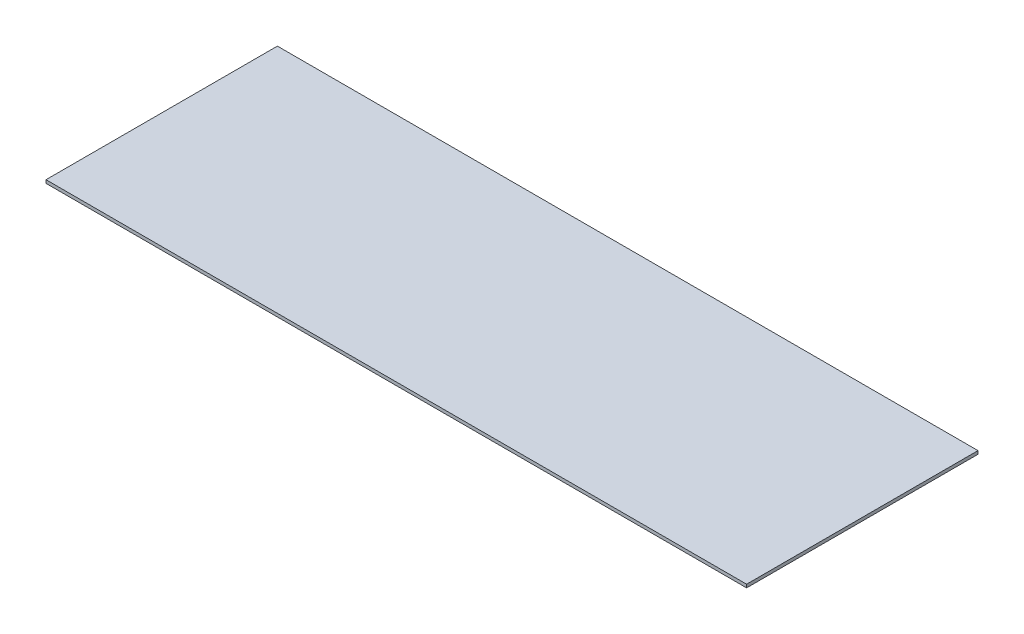
ISO-10303-21;
HEADER;
FILE_DESCRIPTION(('STEP AP214'),'2;1');
FILE_NAME('part.step','',(''),(''),'','','');
FILE_SCHEMA(('AUTOMOTIVE_DESIGN { 1 0 10303 214 1 1 1 1 }'));
ENDSEC;
DATA;
#1=APPLICATION_CONTEXT('core data for automotive mechanical design processes');
#2=APPLICATION_PROTOCOL_DEFINITION('international standard','automotive_design',2000,#1);
#3=PRODUCT_CONTEXT('',#1,'mechanical');
#4=PRODUCT('Part','Part','',(#3));
#5=PRODUCT_RELATED_PRODUCT_CATEGORY('part','',(#4));
#6=PRODUCT_DEFINITION_FORMATION('','',#4);
#7=PRODUCT_DEFINITION_CONTEXT('part definition',#1,'design');
#8=PRODUCT_DEFINITION('design','',#6,#7);
#9=PRODUCT_DEFINITION_SHAPE('','',#8);
#10=(LENGTH_UNIT() NAMED_UNIT(*) SI_UNIT(.MILLI.,.METRE.));
#11=(NAMED_UNIT(*) PLANE_ANGLE_UNIT() SI_UNIT($,.RADIAN.));
#12=(NAMED_UNIT(*) SI_UNIT($,.STERADIAN.) SOLID_ANGLE_UNIT());
#13=UNCERTAINTY_MEASURE_WITH_UNIT(LENGTH_MEASURE(1.E-05),#10,'distance_accuracy_value','');
#14=(GEOMETRIC_REPRESENTATION_CONTEXT(3) GLOBAL_UNCERTAINTY_ASSIGNED_CONTEXT((#13)) GLOBAL_UNIT_ASSIGNED_CONTEXT((#10,
#11,#12)) REPRESENTATION_CONTEXT('',''));
#15=CARTESIAN_POINT('',(0.,0.,0.));
#16=DIRECTION('',(0.,0.,1.));
#17=DIRECTION('',(1.,0.,0.));
#18=AXIS2_PLACEMENT_3D('',#15,#16,#17);
#19=CARTESIAN_POINT('',(-1047.64871435823,5.,-331.739130434783));
#20=DIRECTION('',(1.,0.,0.));
#21=DIRECTION('',(0.,0.,-1.));
#22=AXIS2_PLACEMENT_3D('',#19,#20,#21);
#23=PLANE('',#22);
#24=DIRECTION('',(0.,0.,1.));
#25=VECTOR('',#24,1.);
#26=CARTESIAN_POINT('',(-1047.64871435823,0.,-331.739130434783));
#27=LINE('',#26,#25);
#28=CARTESIAN_POINT('',(-1047.64871435823,0.,-331.739130434783));
#29=VERTEX_POINT('',#28);
#30=CARTESIAN_POINT('',(-1047.64871435823,0.,28.2608695652174));
#31=VERTEX_POINT('',#30);
#32=EDGE_CURVE('E101',#29,#31,#27,.T.);
#33=ORIENTED_EDGE('',*,*,#32,.T.);
#34=DIRECTION('',(0.,-1.,0.));
#35=VECTOR('',#34,1.);
#36=CARTESIAN_POINT('',(-1047.64871435823,5.,28.2608695652174));
#37=LINE('',#36,#35);
#38=CARTESIAN_POINT('',(-1047.64871435823,5.,28.2608695652174));
#39=VERTEX_POINT('',#38);
#40=EDGE_CURVE('E11',#39,#31,#37,.T.);
#41=ORIENTED_EDGE('',*,*,#40,.F.);
#42=DIRECTION('',(0.,0.,1.));
#43=VECTOR('',#42,1.);
#44=CARTESIAN_POINT('',(-1047.64871435823,5.,-331.739130434783));
#45=LINE('',#44,#43);
#46=CARTESIAN_POINT('',(-1047.64871435823,5.,-331.739130434783));
#47=VERTEX_POINT('',#46);
#48=EDGE_CURVE('E89',#47,#39,#45,.T.);
#49=ORIENTED_EDGE('',*,*,#48,.F.);
#50=DIRECTION('',(0.,-1.,0.));
#51=VECTOR('',#50,1.);
#52=CARTESIAN_POINT('',(-1047.64871435823,5.,-331.739130434783));
#53=LINE('',#52,#51);
#54=EDGE_CURVE('E97',#47,#29,#53,.T.);
#55=ORIENTED_EDGE('',*,*,#54,.T.);
#56=EDGE_LOOP('',(#33,#41,#49,#55));
#57=FACE_BOUND('',#56,.T.);
#58=ADVANCED_FACE('F38',(#57),#23,.F.);
#59=CARTESIAN_POINT('',(-1047.64871435823,5.,28.2608695652174));
#60=DIRECTION('',(0.,0.,-1.));
#61=DIRECTION('',(-1.,0.,0.));
#62=AXIS2_PLACEMENT_3D('',#59,#60,#61);
#63=PLANE('',#62);
#64=DIRECTION('',(1.,0.,0.));
#65=VECTOR('',#64,1.);
#66=CARTESIAN_POINT('',(-1047.64871435823,0.,28.2608695652174));
#67=LINE('',#66,#65);
#68=CARTESIAN_POINT('',(42.351285641768,0.,28.2608695652174));
#69=VERTEX_POINT('',#68);
#70=EDGE_CURVE('E93',#31,#69,#67,.T.);
#71=ORIENTED_EDGE('',*,*,#70,.T.);
#72=DIRECTION('',(0.,-1.,0.));
#73=VECTOR('',#72,1.);
#74=CARTESIAN_POINT('',(42.351285641768,5.,28.2608695652174));
#75=LINE('',#74,#73);
#76=CARTESIAN_POINT('',(42.351285641768,5.,28.2608695652174));
#77=VERTEX_POINT('',#76);
#78=EDGE_CURVE('E46',#77,#69,#75,.T.);
#79=ORIENTED_EDGE('',*,*,#78,.F.);
#80=DIRECTION('',(1.,0.,0.));
#81=VECTOR('',#80,1.);
#82=CARTESIAN_POINT('',(-1047.64871435823,5.,28.2608695652174));
#83=LINE('',#82,#81);
#84=EDGE_CURVE('E84',#39,#77,#83,.T.);
#85=ORIENTED_EDGE('',*,*,#84,.F.);
#86=ORIENTED_EDGE('',*,*,#40,.T.);
#87=EDGE_LOOP('',(#71,#79,#85,#86));
#88=FACE_BOUND('',#87,.T.);
#89=ADVANCED_FACE('F92',(#88),#63,.F.);
#90=CARTESIAN_POINT('',(42.351285641768,5.,-331.739130434783));
#91=DIRECTION('',(-1.,0.,0.));
#92=DIRECTION('',(0.,0.,1.));
#93=AXIS2_PLACEMENT_3D('',#90,#91,#92);
#94=PLANE('',#93);
#95=DIRECTION('',(0.,0.,-1.));
#96=VECTOR('',#95,1.);
#97=CARTESIAN_POINT('',(42.351285641768,0.,-331.739130434783));
#98=LINE('',#97,#96);
#99=CARTESIAN_POINT('',(42.351285641768,0.,-331.739130434783));
#100=VERTEX_POINT('',#99);
#101=EDGE_CURVE('E71',#69,#100,#98,.T.);
#102=ORIENTED_EDGE('',*,*,#101,.T.);
#103=DIRECTION('',(0.,-1.,0.));
#104=VECTOR('',#103,1.);
#105=CARTESIAN_POINT('',(42.351285641768,5.,-331.739130434783));
#106=LINE('',#105,#104);
#107=CARTESIAN_POINT('',(42.351285641768,5.,-331.739130434783));
#108=VERTEX_POINT('',#107);
#109=EDGE_CURVE('E94',#108,#100,#106,.T.);
#110=ORIENTED_EDGE('',*,*,#109,.F.);
#111=DIRECTION('',(0.,0.,-1.));
#112=VECTOR('',#111,1.);
#113=CARTESIAN_POINT('',(42.351285641768,5.,-331.739130434783));
#114=LINE('',#113,#112);
#115=EDGE_CURVE('E87',#77,#108,#114,.T.);
#116=ORIENTED_EDGE('',*,*,#115,.F.);
#117=ORIENTED_EDGE('',*,*,#78,.T.);
#118=EDGE_LOOP('',(#102,#110,#116,#117));
#119=FACE_BOUND('',#118,.T.);
#120=ADVANCED_FACE('F95',(#119),#94,.F.);
#121=CARTESIAN_POINT('',(-1047.64871435823,5.,-331.739130434783));
#122=DIRECTION('',(0.,0.,1.));
#123=DIRECTION('',(1.,0.,0.));
#124=AXIS2_PLACEMENT_3D('',#121,#122,#123);
#125=PLANE('',#124);
#126=DIRECTION('',(-1.,0.,0.));
#127=VECTOR('',#126,1.);
#128=CARTESIAN_POINT('',(-1047.64871435823,0.,-331.739130434783));
#129=LINE('',#128,#127);
#130=EDGE_CURVE('E77',#100,#29,#129,.T.);
#131=ORIENTED_EDGE('',*,*,#130,.T.);
#132=ORIENTED_EDGE('',*,*,#54,.F.);
#133=DIRECTION('',(-1.,0.,0.));
#134=VECTOR('',#133,1.);
#135=CARTESIAN_POINT('',(-1047.64871435823,5.,-331.739130434783));
#136=LINE('',#135,#134);
#137=EDGE_CURVE('E54',#108,#47,#136,.T.);
#138=ORIENTED_EDGE('',*,*,#137,.F.);
#139=ORIENTED_EDGE('',*,*,#109,.T.);
#140=EDGE_LOOP('',(#131,#132,#138,#139));
#141=FACE_BOUND('',#140,.T.);
#142=ADVANCED_FACE('F108',(#141),#125,.F.);
#143=CARTESIAN_POINT('',(0.,5.,0.));
#144=DIRECTION('',(0.,1.,0.));
#145=DIRECTION('',(0.,0.,1.));
#146=AXIS2_PLACEMENT_3D('',#143,#144,#145);
#147=PLANE('',#146);
#148=ORIENTED_EDGE('',*,*,#48,.T.);
#149=ORIENTED_EDGE('',*,*,#84,.T.);
#150=ORIENTED_EDGE('',*,*,#115,.T.);
#151=ORIENTED_EDGE('',*,*,#137,.T.);
#152=EDGE_LOOP('',(#148,#149,#150,#151));
#153=FACE_BOUND('',#152,.T.);
#154=ADVANCED_FACE('F85',(#153),#147,.T.);
#155=CARTESIAN_POINT('',(0.,0.,0.));
#156=DIRECTION('',(0.,1.,0.));
#157=DIRECTION('',(0.,0.,1.));
#158=AXIS2_PLACEMENT_3D('',#155,#156,#157);
#159=PLANE('',#158);
#160=ORIENTED_EDGE('',*,*,#32,.F.);
#161=ORIENTED_EDGE('',*,*,#130,.F.);
#162=ORIENTED_EDGE('',*,*,#101,.F.);
#163=ORIENTED_EDGE('',*,*,#70,.F.);
#164=EDGE_LOOP('',(#160,#161,#162,#163));
#165=FACE_BOUND('',#164,.T.);
#166=ADVANCED_FACE('F111',(#165),#159,.F.);
#167=CLOSED_SHELL('',(#58,#89,#120,#142,#154,#166));
#168=MANIFOLD_SOLID_BREP('B2',#167);
#169=ADVANCED_BREP_SHAPE_REPRESENTATION('',(#18,#168),#14);
#170=SHAPE_DEFINITION_REPRESENTATION(#9,#169);
ENDSEC;
END-ISO-10303-21;
